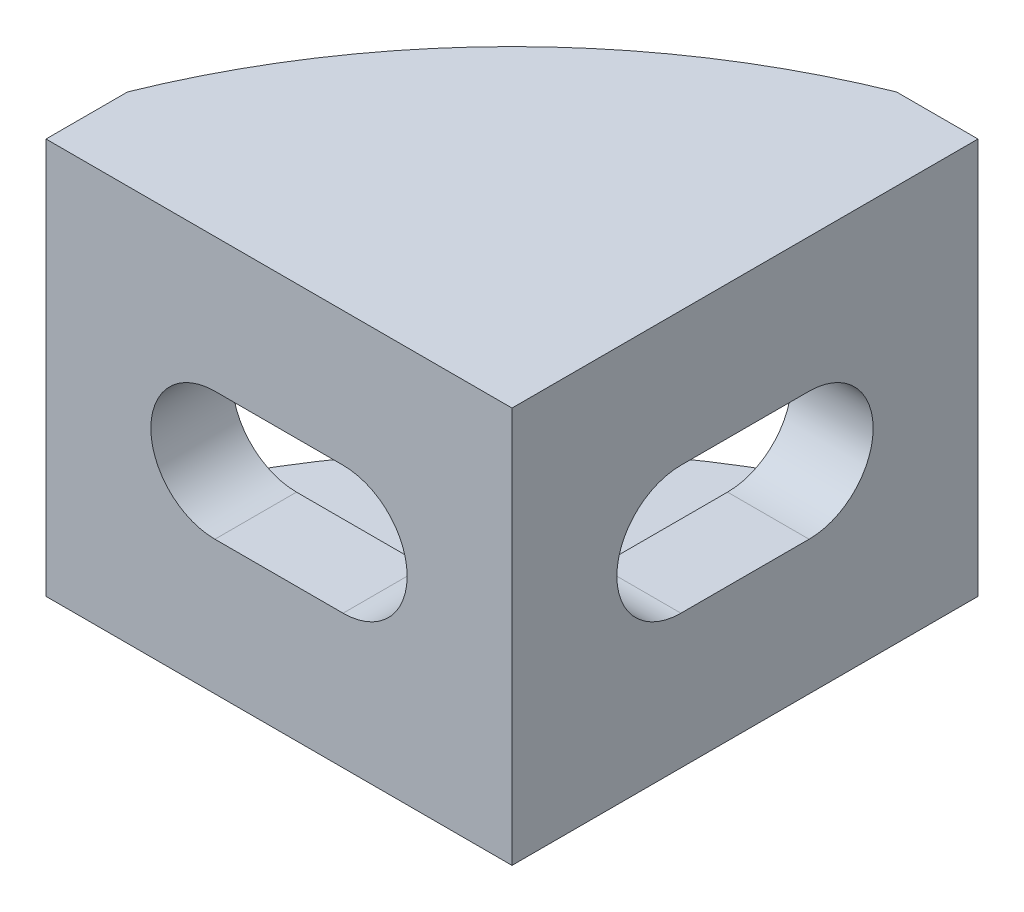
ISO-10303-21;
HEADER;
FILE_DESCRIPTION(('STEP AP214'),'2;1');
FILE_NAME('part.step','',(''),(''),'','','');
FILE_SCHEMA(('AUTOMOTIVE_DESIGN { 1 0 10303 214 1 1 1 1 }'));
ENDSEC;
DATA;
#1=APPLICATION_CONTEXT('core data for automotive mechanical design processes');
#2=APPLICATION_PROTOCOL_DEFINITION('international standard','automotive_design',2000,#1);
#3=PRODUCT_CONTEXT('',#1,'mechanical');
#4=PRODUCT('Part','Part','',(#3));
#5=PRODUCT_RELATED_PRODUCT_CATEGORY('part','',(#4));
#6=PRODUCT_DEFINITION_FORMATION('','',#4);
#7=PRODUCT_DEFINITION_CONTEXT('part definition',#1,'design');
#8=PRODUCT_DEFINITION('design','',#6,#7);
#9=PRODUCT_DEFINITION_SHAPE('','',#8);
#10=(LENGTH_UNIT() NAMED_UNIT(*) SI_UNIT(.MILLI.,.METRE.));
#11=(NAMED_UNIT(*) PLANE_ANGLE_UNIT() SI_UNIT($,.RADIAN.));
#12=(NAMED_UNIT(*) SI_UNIT($,.STERADIAN.) SOLID_ANGLE_UNIT());
#13=UNCERTAINTY_MEASURE_WITH_UNIT(LENGTH_MEASURE(1.E-05),#10,'distance_accuracy_value','');
#14=(GEOMETRIC_REPRESENTATION_CONTEXT(3) GLOBAL_UNCERTAINTY_ASSIGNED_CONTEXT((#13)) GLOBAL_UNIT_ASSIGNED_CONTEXT((#10,
#11,#12)) REPRESENTATION_CONTEXT('',''));
#15=CARTESIAN_POINT('',(0.,0.,0.));
#16=DIRECTION('',(0.,0.,1.));
#17=DIRECTION('',(1.,0.,0.));
#18=AXIS2_PLACEMENT_3D('',#15,#16,#17);
#19=CARTESIAN_POINT('',(7.60372741196111,8.5,7.60372741196111));
#20=DIRECTION('',(0.,-1.,0.));
#21=DIRECTION('',(0.,0.,-1.));
#22=AXIS2_PLACEMENT_3D('',#19,#20,#21);
#23=CYLINDRICAL_SURFACE('',#22,29.7532944305835);
#24=DIRECTION('',(0.,-1.,0.));
#25=VECTOR('',#24,1.);
#26=CARTESIAN_POINT('',(-20.,8.5,-3.5));
#27=LINE('',#26,#25);
#28=CARTESIAN_POINT('',(-20.,-6.5,-3.5));
#29=VERTEX_POINT('',#28);
#30=CARTESIAN_POINT('',(-20.,-8.5,-3.5));
#31=VERTEX_POINT('',#30);
#32=EDGE_CURVE('E262',#29,#31,#27,.T.);
#33=ORIENTED_EDGE('',*,*,#32,.F.);
#34=CARTESIAN_POINT('',(7.60372741196111,-6.5,7.60372741196111));
#35=DIRECTION('',(0.,-1.,0.));
#36=DIRECTION('',(0.,0.,-1.));
#37=AXIS2_PLACEMENT_3D('',#34,#35,#36);
#38=CIRCLE('',#37,29.7532944305835);
#39=CARTESIAN_POINT('',(-3.49999999999999,-6.5,-20.));
#40=VERTEX_POINT('',#39);
#41=EDGE_CURVE('E11',#29,#40,#38,.T.);
#42=ORIENTED_EDGE('',*,*,#41,.T.);
#43=DIRECTION('',(0.,-1.,0.));
#44=VECTOR('',#43,1.);
#45=CARTESIAN_POINT('',(-3.49999999999999,8.5,-20.));
#46=LINE('',#45,#44);
#47=CARTESIAN_POINT('',(-3.49999999999999,-8.5,-20.));
#48=VERTEX_POINT('',#47);
#49=EDGE_CURVE('E266',#40,#48,#46,.T.);
#50=ORIENTED_EDGE('',*,*,#49,.T.);
#51=CARTESIAN_POINT('',(7.60372741196111,-8.5,7.60372741196111));
#52=DIRECTION('',(0.,1.,0.));
#53=DIRECTION('',(0.,0.,1.));
#54=AXIS2_PLACEMENT_3D('',#51,#52,#53);
#55=CIRCLE('',#54,29.7532944305835);
#56=EDGE_CURVE('E246',#48,#31,#55,.T.);
#57=ORIENTED_EDGE('',*,*,#56,.T.);
#58=EDGE_LOOP('',(#33,#42,#50,#57));
#59=FACE_BOUND('',#58,.T.);
#60=ADVANCED_FACE('F33',(#59),#23,.T.);
#61=CARTESIAN_POINT('',(0.,8.5,-20.));
#62=DIRECTION('',(0.,0.,1.));
#63=DIRECTION('',(1.,0.,0.));
#64=AXIS2_PLACEMENT_3D('',#61,#62,#63);
#65=PLANE('',#64);
#66=DIRECTION('',(-1.,0.,0.));
#67=VECTOR('',#66,1.);
#68=CARTESIAN_POINT('',(0.,-8.5,-20.));
#69=LINE('',#68,#67);
#70=CARTESIAN_POINT('',(0.,-8.5,-20.));
#71=VERTEX_POINT('',#70);
#72=EDGE_CURVE('E229',#71,#48,#69,.T.);
#73=ORIENTED_EDGE('',*,*,#72,.T.);
#74=ORIENTED_EDGE('',*,*,#49,.F.);
#75=DIRECTION('',(0.,-1.,0.));
#76=VECTOR('',#75,1.);
#77=CARTESIAN_POINT('',(-3.49999999999999,-6.5,-20.));
#78=LINE('',#77,#76);
#79=CARTESIAN_POINT('',(-3.49999999999999,6.5,-20.));
#80=VERTEX_POINT('',#79);
#81=EDGE_CURVE('E219',#80,#40,#78,.T.);
#82=ORIENTED_EDGE('',*,*,#81,.F.);
#83=CARTESIAN_POINT('',(-3.49999999999999,8.5,-20.));
#84=VERTEX_POINT('',#83);
#85=EDGE_CURVE('E267',#84,#80,#46,.T.);
#86=ORIENTED_EDGE('',*,*,#85,.F.);
#87=DIRECTION('',(-1.,0.,0.));
#88=VECTOR('',#87,1.);
#89=CARTESIAN_POINT('',(0.,8.5,-20.));
#90=LINE('',#89,#88);
#91=CARTESIAN_POINT('',(0.,8.5,-20.));
#92=VERTEX_POINT('',#91);
#93=EDGE_CURVE('E231',#92,#84,#90,.T.);
#94=ORIENTED_EDGE('',*,*,#93,.F.);
#95=DIRECTION('',(0.,-1.,0.));
#96=VECTOR('',#95,1.);
#97=CARTESIAN_POINT('',(0.,8.5,-20.));
#98=LINE('',#97,#96);
#99=EDGE_CURVE('E243',#92,#71,#98,.T.);
#100=ORIENTED_EDGE('',*,*,#99,.T.);
#101=EDGE_LOOP('',(#73,#74,#82,#86,#94,#100));
#102=FACE_BOUND('',#101,.T.);
#103=ADVANCED_FACE('F35',(#102),#65,.F.);
#104=ORIENTED_EDGE('',*,*,#85,.T.);
#105=CARTESIAN_POINT('',(7.60372741196111,6.5,7.60372741196111));
#106=DIRECTION('',(0.,1.,0.));
#107=DIRECTION('',(0.,0.,1.));
#108=AXIS2_PLACEMENT_3D('',#105,#106,#107);
#109=CIRCLE('',#108,29.7532944305835);
#110=CARTESIAN_POINT('',(-20.,6.5,-3.5));
#111=VERTEX_POINT('',#110);
#112=EDGE_CURVE('E41',#80,#111,#109,.T.);
#113=ORIENTED_EDGE('',*,*,#112,.T.);
#114=CARTESIAN_POINT('',(-20.,8.5,-3.5));
#115=VERTEX_POINT('',#114);
#116=EDGE_CURVE('E263',#115,#111,#27,.T.);
#117=ORIENTED_EDGE('',*,*,#116,.F.);
#118=CARTESIAN_POINT('',(7.60372741196111,8.5,7.60372741196111));
#119=DIRECTION('',(0.,1.,0.));
#120=DIRECTION('',(0.,0.,1.));
#121=AXIS2_PLACEMENT_3D('',#118,#119,#120);
#122=CIRCLE('',#121,29.7532944305835);
#123=EDGE_CURVE('E234',#84,#115,#122,.T.);
#124=ORIENTED_EDGE('',*,*,#123,.F.);
#125=EDGE_LOOP('',(#104,#113,#117,#124));
#126=FACE_BOUND('',#125,.T.);
#127=ADVANCED_FACE('F272',(#126),#23,.T.);
#128=CARTESIAN_POINT('',(-20.,8.5,0.));
#129=DIRECTION('',(1.,0.,0.));
#130=DIRECTION('',(0.,0.,-1.));
#131=AXIS2_PLACEMENT_3D('',#128,#129,#130);
#132=PLANE('',#131);
#133=DIRECTION('',(0.,0.,1.));
#134=VECTOR('',#133,1.);
#135=CARTESIAN_POINT('',(-20.,-8.5,0.));
#136=LINE('',#135,#134);
#137=CARTESIAN_POINT('',(-20.,-8.5,0.));
#138=VERTEX_POINT('',#137);
#139=EDGE_CURVE('E249',#31,#138,#136,.T.);
#140=ORIENTED_EDGE('',*,*,#139,.T.);
#141=DIRECTION('',(0.,-1.,0.));
#142=VECTOR('',#141,1.);
#143=CARTESIAN_POINT('',(-20.,8.5,0.));
#144=LINE('',#143,#142);
#145=CARTESIAN_POINT('',(-20.,8.5,0.));
#146=VERTEX_POINT('',#145);
#147=EDGE_CURVE('E259',#146,#138,#144,.T.);
#148=ORIENTED_EDGE('',*,*,#147,.F.);
#149=DIRECTION('',(0.,0.,1.));
#150=VECTOR('',#149,1.);
#151=CARTESIAN_POINT('',(-20.,8.5,0.));
#152=LINE('',#151,#150);
#153=EDGE_CURVE('E237',#115,#146,#152,.T.);
#154=ORIENTED_EDGE('',*,*,#153,.F.);
#155=ORIENTED_EDGE('',*,*,#116,.T.);
#156=DIRECTION('',(0.,1.,0.));
#157=VECTOR('',#156,1.);
#158=CARTESIAN_POINT('',(-20.,-6.5,-3.5));
#159=LINE('',#158,#157);
#160=EDGE_CURVE('E212',#29,#111,#159,.T.);
#161=ORIENTED_EDGE('',*,*,#160,.F.);
#162=ORIENTED_EDGE('',*,*,#32,.T.);
#163=EDGE_LOOP('',(#140,#148,#154,#155,#161,#162));
#164=FACE_BOUND('',#163,.T.);
#165=ADVANCED_FACE('F279',(#164),#132,.F.);
#166=CARTESIAN_POINT('',(0.,8.5,0.));
#167=DIRECTION('',(0.,0.,-1.));
#168=DIRECTION('',(-1.,0.,0.));
#169=AXIS2_PLACEMENT_3D('',#166,#167,#168);
#170=PLANE('',#169);
#171=DIRECTION('',(-1.,0.,0.));
#172=VECTOR('',#171,1.);
#173=CARTESIAN_POINT('',(-7.25,2.75,0.));
#174=LINE('',#173,#172);
#175=CARTESIAN_POINT('',(-7.25,2.75,0.));
#176=VERTEX_POINT('',#175);
#177=CARTESIAN_POINT('',(-12.75,2.75,0.));
#178=VERTEX_POINT('',#177);
#179=EDGE_CURVE('E194',#176,#178,#174,.T.);
#180=ORIENTED_EDGE('',*,*,#179,.F.);
#181=CARTESIAN_POINT('',(-7.25,0.,0.));
#182=DIRECTION('',(0.,0.,1.));
#183=DIRECTION('',(1.,0.,0.));
#184=AXIS2_PLACEMENT_3D('',#181,#182,#183);
#185=CIRCLE('',#184,2.75);
#186=CARTESIAN_POINT('',(-7.25,-2.75,0.));
#187=VERTEX_POINT('',#186);
#188=EDGE_CURVE('E183',#187,#176,#185,.T.);
#189=ORIENTED_EDGE('',*,*,#188,.F.);
#190=DIRECTION('',(1.,0.,0.));
#191=VECTOR('',#190,1.);
#192=CARTESIAN_POINT('',(-12.75,-2.75,0.));
#193=LINE('',#192,#191);
#194=CARTESIAN_POINT('',(-12.75,-2.75,0.));
#195=VERTEX_POINT('',#194);
#196=EDGE_CURVE('E200',#195,#187,#193,.T.);
#197=ORIENTED_EDGE('',*,*,#196,.F.);
#198=CARTESIAN_POINT('',(-12.75,0.,0.));
#199=DIRECTION('',(0.,0.,1.));
#200=DIRECTION('',(1.,0.,0.));
#201=AXIS2_PLACEMENT_3D('',#198,#199,#200);
#202=CIRCLE('',#201,2.75);
#203=EDGE_CURVE('E197',#178,#195,#202,.T.);
#204=ORIENTED_EDGE('',*,*,#203,.F.);
#205=EDGE_LOOP('',(#180,#189,#197,#204));
#206=FACE_BOUND('',#205,.T.);
#207=DIRECTION('',(1.,0.,0.));
#208=VECTOR('',#207,1.);
#209=CARTESIAN_POINT('',(0.,-8.5,0.));
#210=LINE('',#209,#208);
#211=CARTESIAN_POINT('',(0.,-8.5,0.));
#212=VERTEX_POINT('',#211);
#213=EDGE_CURVE('E251',#138,#212,#210,.T.);
#214=ORIENTED_EDGE('',*,*,#213,.T.);
#215=DIRECTION('',(0.,-1.,0.));
#216=VECTOR('',#215,1.);
#217=CARTESIAN_POINT('',(0.,8.5,0.));
#218=LINE('',#217,#216);
#219=CARTESIAN_POINT('',(0.,8.5,0.));
#220=VERTEX_POINT('',#219);
#221=EDGE_CURVE('E256',#220,#212,#218,.T.);
#222=ORIENTED_EDGE('',*,*,#221,.F.);
#223=DIRECTION('',(1.,0.,0.));
#224=VECTOR('',#223,1.);
#225=CARTESIAN_POINT('',(0.,8.5,0.));
#226=LINE('',#225,#224);
#227=EDGE_CURVE('E239',#146,#220,#226,.T.);
#228=ORIENTED_EDGE('',*,*,#227,.F.);
#229=ORIENTED_EDGE('',*,*,#147,.T.);
#230=EDGE_LOOP('',(#214,#222,#228,#229));
#231=FACE_BOUND('',#230,.T.);
#232=ADVANCED_FACE('F303',(#206,#231),#170,.F.);
#233=CARTESIAN_POINT('',(0.,8.5,-20.));
#234=DIRECTION('',(-1.,0.,0.));
#235=DIRECTION('',(0.,0.,1.));
#236=AXIS2_PLACEMENT_3D('',#233,#234,#235);
#237=PLANE('',#236);
#238=CARTESIAN_POINT('',(0.,0.,-12.75));
#239=DIRECTION('',(1.,0.,0.));
#240=DIRECTION('',(0.,0.,1.));
#241=AXIS2_PLACEMENT_3D('',#238,#239,#240);
#242=CIRCLE('',#241,2.75);
#243=CARTESIAN_POINT('',(0.,-2.75,-12.75));
#244=VERTEX_POINT('',#243);
#245=CARTESIAN_POINT('',(0.,2.75,-12.75));
#246=VERTEX_POINT('',#245);
#247=EDGE_CURVE('E170',#244,#246,#242,.T.);
#248=ORIENTED_EDGE('',*,*,#247,.F.);
#249=DIRECTION('',(0.,0.,-1.));
#250=VECTOR('',#249,1.);
#251=CARTESIAN_POINT('',(0.,-2.75,-12.75));
#252=LINE('',#251,#250);
#253=CARTESIAN_POINT('',(0.,-2.75,-7.25));
#254=VERTEX_POINT('',#253);
#255=EDGE_CURVE('E163',#254,#244,#252,.T.);
#256=ORIENTED_EDGE('',*,*,#255,.F.);
#257=CARTESIAN_POINT('',(0.,0.,-7.25));
#258=DIRECTION('',(1.,0.,0.));
#259=DIRECTION('',(0.,0.,1.));
#260=AXIS2_PLACEMENT_3D('',#257,#258,#259);
#261=CIRCLE('',#260,2.75);
#262=CARTESIAN_POINT('',(0.,2.75,-7.25));
#263=VERTEX_POINT('',#262);
#264=EDGE_CURVE('E174',#263,#254,#261,.T.);
#265=ORIENTED_EDGE('',*,*,#264,.F.);
#266=DIRECTION('',(0.,0.,1.));
#267=VECTOR('',#266,1.);
#268=CARTESIAN_POINT('',(0.,2.75,-7.25));
#269=LINE('',#268,#267);
#270=EDGE_CURVE('E48',#246,#263,#269,.T.);
#271=ORIENTED_EDGE('',*,*,#270,.F.);
#272=EDGE_LOOP('',(#248,#256,#265,#271));
#273=FACE_BOUND('',#272,.T.);
#274=DIRECTION('',(0.,0.,-1.));
#275=VECTOR('',#274,1.);
#276=CARTESIAN_POINT('',(0.,-8.5,-20.));
#277=LINE('',#276,#275);
#278=EDGE_CURVE('E235',#212,#71,#277,.T.);
#279=ORIENTED_EDGE('',*,*,#278,.T.);
#280=ORIENTED_EDGE('',*,*,#99,.F.);
#281=DIRECTION('',(0.,0.,-1.));
#282=VECTOR('',#281,1.);
#283=CARTESIAN_POINT('',(0.,8.5,-20.));
#284=LINE('',#283,#282);
#285=EDGE_CURVE('E241',#220,#92,#284,.T.);
#286=ORIENTED_EDGE('',*,*,#285,.F.);
#287=ORIENTED_EDGE('',*,*,#221,.T.);
#288=EDGE_LOOP('',(#279,#280,#286,#287));
#289=FACE_BOUND('',#288,.T.);
#290=ADVANCED_FACE('F308',(#273,#289),#237,.F.);
#291=CARTESIAN_POINT('',(7.60372741196111,8.5,7.60372741196111));
#292=DIRECTION('',(0.,1.,0.));
#293=DIRECTION('',(0.,0.,1.));
#294=AXIS2_PLACEMENT_3D('',#291,#292,#293);
#295=PLANE('',#294);
#296=ORIENTED_EDGE('',*,*,#93,.T.);
#297=ORIENTED_EDGE('',*,*,#123,.T.);
#298=ORIENTED_EDGE('',*,*,#153,.T.);
#299=ORIENTED_EDGE('',*,*,#227,.T.);
#300=ORIENTED_EDGE('',*,*,#285,.T.);
#301=EDGE_LOOP('',(#296,#297,#298,#299,#300));
#302=FACE_BOUND('',#301,.T.);
#303=ADVANCED_FACE('F283',(#302),#295,.T.);
#304=CARTESIAN_POINT('',(7.60372741196111,-8.5,7.60372741196111));
#305=DIRECTION('',(0.,1.,0.));
#306=DIRECTION('',(0.,0.,1.));
#307=AXIS2_PLACEMENT_3D('',#304,#305,#306);
#308=PLANE('',#307);
#309=ORIENTED_EDGE('',*,*,#72,.F.);
#310=ORIENTED_EDGE('',*,*,#278,.F.);
#311=ORIENTED_EDGE('',*,*,#213,.F.);
#312=ORIENTED_EDGE('',*,*,#139,.F.);
#313=ORIENTED_EDGE('',*,*,#56,.F.);
#314=EDGE_LOOP('',(#309,#310,#311,#312,#313));
#315=FACE_BOUND('',#314,.T.);
#316=ADVANCED_FACE('F306',(#315),#308,.F.);
#317=CARTESIAN_POINT('',(-3.49999999999999,-6.5,-3.5));
#318=DIRECTION('',(0.,-1.,0.));
#319=DIRECTION('',(0.,0.,-1.));
#320=AXIS2_PLACEMENT_3D('',#317,#318,#319);
#321=PLANE('',#320);
#322=DIRECTION('',(-1.,0.,0.));
#323=VECTOR('',#322,1.);
#324=CARTESIAN_POINT('',(-3.49999999999999,-6.5,-3.5));
#325=LINE('',#324,#323);
#326=CARTESIAN_POINT('',(-3.49999999999999,-6.5,-3.5));
#327=VERTEX_POINT('',#326);
#328=EDGE_CURVE('E227',#327,#29,#325,.T.);
#329=ORIENTED_EDGE('',*,*,#328,.F.);
#330=DIRECTION('',(0.,0.,1.));
#331=VECTOR('',#330,1.);
#332=CARTESIAN_POINT('',(-3.49999999999999,-6.5,-3.5));
#333=LINE('',#332,#331);
#334=EDGE_CURVE('E221',#40,#327,#333,.T.);
#335=ORIENTED_EDGE('',*,*,#334,.F.);
#336=ORIENTED_EDGE('',*,*,#41,.F.);
#337=EDGE_LOOP('',(#329,#335,#336));
#338=FACE_BOUND('',#337,.T.);
#339=ADVANCED_FACE('F294',(#338),#321,.F.);
#340=CARTESIAN_POINT('',(-3.49999999999999,6.5,-3.5));
#341=DIRECTION('',(0.,1.,0.));
#342=DIRECTION('',(0.,0.,1.));
#343=AXIS2_PLACEMENT_3D('',#340,#341,#342);
#344=PLANE('',#343);
#345=DIRECTION('',(0.,0.,-1.));
#346=VECTOR('',#345,1.);
#347=CARTESIAN_POINT('',(-3.49999999999999,6.5,-3.5));
#348=LINE('',#347,#346);
#349=CARTESIAN_POINT('',(-3.49999999999999,6.5,-3.5));
#350=VERTEX_POINT('',#349);
#351=EDGE_CURVE('E216',#350,#80,#348,.T.);
#352=ORIENTED_EDGE('',*,*,#351,.F.);
#353=DIRECTION('',(-1.,0.,0.));
#354=VECTOR('',#353,1.);
#355=CARTESIAN_POINT('',(-3.49999999999999,6.5,-3.5));
#356=LINE('',#355,#354);
#357=EDGE_CURVE('E224',#350,#111,#356,.T.);
#358=ORIENTED_EDGE('',*,*,#357,.T.);
#359=ORIENTED_EDGE('',*,*,#112,.F.);
#360=EDGE_LOOP('',(#352,#358,#359));
#361=FACE_BOUND('',#360,.T.);
#362=ADVANCED_FACE('F343',(#361),#344,.F.);
#363=CARTESIAN_POINT('',(-3.49999999999999,-6.5,-3.5));
#364=DIRECTION('',(0.,0.,1.));
#365=DIRECTION('',(1.,0.,0.));
#366=AXIS2_PLACEMENT_3D('',#363,#364,#365);
#367=PLANE('',#366);
#368=DIRECTION('',(-1.,0.,0.));
#369=VECTOR('',#368,1.);
#370=CARTESIAN_POINT('',(-12.75,-2.75,-3.5));
#371=LINE('',#370,#369);
#372=CARTESIAN_POINT('',(-7.25,-2.75,-3.5));
#373=VERTEX_POINT('',#372);
#374=CARTESIAN_POINT('',(-12.75,-2.75,-3.5));
#375=VERTEX_POINT('',#374);
#376=EDGE_CURVE('E187',#373,#375,#371,.T.);
#377=ORIENTED_EDGE('',*,*,#376,.F.);
#378=CARTESIAN_POINT('',(-7.25,0.,-3.5));
#379=DIRECTION('',(0.,0.,1.));
#380=DIRECTION('',(1.,0.,0.));
#381=AXIS2_PLACEMENT_3D('',#378,#379,#380);
#382=CIRCLE('',#381,2.75);
#383=CARTESIAN_POINT('',(-7.25,2.75,-3.5));
#384=VERTEX_POINT('',#383);
#385=EDGE_CURVE('E190',#384,#373,#382,.F.);
#386=ORIENTED_EDGE('',*,*,#385,.F.);
#387=DIRECTION('',(1.,0.,0.));
#388=VECTOR('',#387,1.);
#389=CARTESIAN_POINT('',(-7.25,2.75,-3.5));
#390=LINE('',#389,#388);
#391=CARTESIAN_POINT('',(-12.75,2.75,-3.5));
#392=VERTEX_POINT('',#391);
#393=EDGE_CURVE('E192',#392,#384,#390,.T.);
#394=ORIENTED_EDGE('',*,*,#393,.F.);
#395=CARTESIAN_POINT('',(-12.75,0.,-3.5));
#396=DIRECTION('',(0.,0.,1.));
#397=DIRECTION('',(1.,0.,0.));
#398=AXIS2_PLACEMENT_3D('',#395,#396,#397);
#399=CIRCLE('',#398,2.75);
#400=EDGE_CURVE('E184',#375,#392,#399,.F.);
#401=ORIENTED_EDGE('',*,*,#400,.F.);
#402=EDGE_LOOP('',(#377,#386,#394,#401));
#403=FACE_BOUND('',#402,.T.);
#404=ORIENTED_EDGE('',*,*,#160,.T.);
#405=ORIENTED_EDGE('',*,*,#357,.F.);
#406=DIRECTION('',(0.,1.,0.));
#407=VECTOR('',#406,1.);
#408=CARTESIAN_POINT('',(-3.49999999999999,-6.5,-3.5));
#409=LINE('',#408,#407);
#410=EDGE_CURVE('E213',#327,#350,#409,.T.);
#411=ORIENTED_EDGE('',*,*,#410,.F.);
#412=ORIENTED_EDGE('',*,*,#328,.T.);
#413=EDGE_LOOP('',(#404,#405,#411,#412));
#414=FACE_BOUND('',#413,.T.);
#415=ADVANCED_FACE('F347',(#403,#414),#367,.F.);
#416=CARTESIAN_POINT('',(-3.49999999999999,0.,0.));
#417=DIRECTION('',(-1.,0.,0.));
#418=DIRECTION('',(0.,0.,1.));
#419=AXIS2_PLACEMENT_3D('',#416,#417,#418);
#420=PLANE('',#419);
#421=DIRECTION('',(0.,0.,-1.));
#422=VECTOR('',#421,1.);
#423=CARTESIAN_POINT('',(-3.49999999999999,-2.75,-12.75));
#424=LINE('',#423,#422);
#425=CARTESIAN_POINT('',(-3.49999999999999,-2.75,-7.25));
#426=VERTEX_POINT('',#425);
#427=CARTESIAN_POINT('',(-3.49999999999999,-2.75,-12.75));
#428=VERTEX_POINT('',#427);
#429=EDGE_CURVE('E160',#426,#428,#424,.T.);
#430=ORIENTED_EDGE('',*,*,#429,.T.);
#431=CARTESIAN_POINT('',(-3.49999999999999,0.,-12.75));
#432=DIRECTION('',(-1.,0.,0.));
#433=DIRECTION('',(0.,0.,1.));
#434=AXIS2_PLACEMENT_3D('',#431,#432,#433);
#435=CIRCLE('',#434,2.75);
#436=CARTESIAN_POINT('',(-3.49999999999999,2.75,-12.75));
#437=VERTEX_POINT('',#436);
#438=EDGE_CURVE('E147',#428,#437,#435,.F.);
#439=ORIENTED_EDGE('',*,*,#438,.T.);
#440=DIRECTION('',(0.,0.,1.));
#441=VECTOR('',#440,1.);
#442=CARTESIAN_POINT('',(-3.49999999999999,2.75,-7.25));
#443=LINE('',#442,#441);
#444=CARTESIAN_POINT('',(-3.49999999999999,2.75,-7.25));
#445=VERTEX_POINT('',#444);
#446=EDGE_CURVE('E178',#437,#445,#443,.T.);
#447=ORIENTED_EDGE('',*,*,#446,.T.);
#448=CARTESIAN_POINT('',(-3.49999999999999,0.,-7.25));
#449=DIRECTION('',(-1.,0.,0.));
#450=DIRECTION('',(0.,0.,1.));
#451=AXIS2_PLACEMENT_3D('',#448,#449,#450);
#452=CIRCLE('',#451,2.75);
#453=EDGE_CURVE('E168',#445,#426,#452,.F.);
#454=ORIENTED_EDGE('',*,*,#453,.T.);
#455=EDGE_LOOP('',(#430,#439,#447,#454));
#456=FACE_BOUND('',#455,.T.);
#457=ORIENTED_EDGE('',*,*,#410,.T.);
#458=ORIENTED_EDGE('',*,*,#351,.T.);
#459=ORIENTED_EDGE('',*,*,#81,.T.);
#460=ORIENTED_EDGE('',*,*,#334,.T.);
#461=EDGE_LOOP('',(#457,#458,#459,#460));
#462=FACE_BOUND('',#461,.T.);
#463=ADVANCED_FACE('F166',(#456,#462),#420,.T.);
#464=CARTESIAN_POINT('',(-7.25,0.,-15.7983738762488));
#465=DIRECTION('',(0.,0.,1.));
#466=DIRECTION('',(1.,0.,0.));
#467=AXIS2_PLACEMENT_3D('',#464,#465,#466);
#468=CYLINDRICAL_SURFACE('',#467,2.75);
#469=ORIENTED_EDGE('',*,*,#385,.T.);
#470=DIRECTION('',(0.,0.,1.));
#471=VECTOR('',#470,1.);
#472=CARTESIAN_POINT('',(-7.25,-2.75,-15.7983738762488));
#473=LINE('',#472,#471);
#474=EDGE_CURVE('E188',#373,#187,#473,.T.);
#475=ORIENTED_EDGE('',*,*,#474,.T.);
#476=ORIENTED_EDGE('',*,*,#188,.T.);
#477=DIRECTION('',(0.,0.,1.));
#478=VECTOR('',#477,1.);
#479=CARTESIAN_POINT('',(-7.25,2.75,-15.7983738762488));
#480=LINE('',#479,#478);
#481=EDGE_CURVE('E203',#384,#176,#480,.T.);
#482=ORIENTED_EDGE('',*,*,#481,.F.);
#483=EDGE_LOOP('',(#469,#475,#476,#482));
#484=FACE_BOUND('',#483,.T.);
#485=ADVANCED_FACE('F359',(#484),#468,.F.);
#486=CARTESIAN_POINT('',(-12.75,-2.75,-15.7983738762488));
#487=DIRECTION('',(0.,-1.,0.));
#488=DIRECTION('',(1.,0.,0.));
#489=AXIS2_PLACEMENT_3D('',#486,#487,#488);
#490=PLANE('',#489);
#491=ORIENTED_EDGE('',*,*,#376,.T.);
#492=DIRECTION('',(0.,0.,1.));
#493=VECTOR('',#492,1.);
#494=CARTESIAN_POINT('',(-12.75,-2.75,-15.7983738762488));
#495=LINE('',#494,#493);
#496=EDGE_CURVE('E205',#375,#195,#495,.T.);
#497=ORIENTED_EDGE('',*,*,#496,.T.);
#498=ORIENTED_EDGE('',*,*,#196,.T.);
#499=ORIENTED_EDGE('',*,*,#474,.F.);
#500=EDGE_LOOP('',(#491,#497,#498,#499));
#501=FACE_BOUND('',#500,.T.);
#502=ADVANCED_FACE('F364',(#501),#490,.F.);
#503=CARTESIAN_POINT('',(-12.75,0.,-15.7983738762488));
#504=DIRECTION('',(0.,0.,1.));
#505=DIRECTION('',(1.,0.,0.));
#506=AXIS2_PLACEMENT_3D('',#503,#504,#505);
#507=CYLINDRICAL_SURFACE('',#506,2.75);
#508=ORIENTED_EDGE('',*,*,#400,.T.);
#509=DIRECTION('',(0.,0.,1.));
#510=VECTOR('',#509,1.);
#511=CARTESIAN_POINT('',(-12.75,2.75,-15.7983738762488));
#512=LINE('',#511,#510);
#513=EDGE_CURVE('E207',#392,#178,#512,.T.);
#514=ORIENTED_EDGE('',*,*,#513,.T.);
#515=ORIENTED_EDGE('',*,*,#203,.T.);
#516=ORIENTED_EDGE('',*,*,#496,.F.);
#517=EDGE_LOOP('',(#508,#514,#515,#516));
#518=FACE_BOUND('',#517,.T.);
#519=ADVANCED_FACE('F374',(#518),#507,.F.);
#520=CARTESIAN_POINT('',(-7.25,2.75,-15.7983738762488));
#521=DIRECTION('',(0.,1.,0.));
#522=DIRECTION('',(0.,0.,1.));
#523=AXIS2_PLACEMENT_3D('',#520,#521,#522);
#524=PLANE('',#523);
#525=ORIENTED_EDGE('',*,*,#393,.T.);
#526=ORIENTED_EDGE('',*,*,#481,.T.);
#527=ORIENTED_EDGE('',*,*,#179,.T.);
#528=ORIENTED_EDGE('',*,*,#513,.F.);
#529=EDGE_LOOP('',(#525,#526,#527,#528));
#530=FACE_BOUND('',#529,.T.);
#531=ADVANCED_FACE('F384',(#530),#524,.F.);
#532=CARTESIAN_POINT('',(-15.7983738762488,-2.75,-12.75));
#533=DIRECTION('',(0.,-1.,0.));
#534=DIRECTION('',(0.,0.,-1.));
#535=AXIS2_PLACEMENT_3D('',#532,#533,#534);
#536=PLANE('',#535);
#537=DIRECTION('',(1.,0.,0.));
#538=VECTOR('',#537,1.);
#539=CARTESIAN_POINT('',(-15.7983738762488,-2.75,-7.25));
#540=LINE('',#539,#538);
#541=EDGE_CURVE('E56',#426,#254,#540,.T.);
#542=ORIENTED_EDGE('',*,*,#541,.T.);
#543=ORIENTED_EDGE('',*,*,#255,.T.);
#544=DIRECTION('',(1.,0.,0.));
#545=VECTOR('',#544,1.);
#546=CARTESIAN_POINT('',(-15.7983738762488,-2.75,-12.75));
#547=LINE('',#546,#545);
#548=EDGE_CURVE('E151',#428,#244,#547,.T.);
#549=ORIENTED_EDGE('',*,*,#548,.F.);
#550=ORIENTED_EDGE('',*,*,#429,.F.);
#551=EDGE_LOOP('',(#542,#543,#549,#550));
#552=FACE_BOUND('',#551,.T.);
#553=ADVANCED_FACE('F159',(#552),#536,.F.);
#554=CARTESIAN_POINT('',(-15.7983738762488,0.,-12.75));
#555=DIRECTION('',(1.,0.,0.));
#556=DIRECTION('',(0.,0.,-1.));
#557=AXIS2_PLACEMENT_3D('',#554,#555,#556);
#558=CYLINDRICAL_SURFACE('',#557,2.75);
#559=ORIENTED_EDGE('',*,*,#548,.T.);
#560=ORIENTED_EDGE('',*,*,#247,.T.);
#561=DIRECTION('',(1.,0.,0.));
#562=VECTOR('',#561,1.);
#563=CARTESIAN_POINT('',(-15.7983738762488,2.75,-12.75));
#564=LINE('',#563,#562);
#565=EDGE_CURVE('E153',#437,#246,#564,.T.);
#566=ORIENTED_EDGE('',*,*,#565,.F.);
#567=ORIENTED_EDGE('',*,*,#438,.F.);
#568=EDGE_LOOP('',(#559,#560,#566,#567));
#569=FACE_BOUND('',#568,.T.);
#570=ADVANCED_FACE('F149',(#569),#558,.F.);
#571=CARTESIAN_POINT('',(-15.7983738762488,2.75,-7.25));
#572=DIRECTION('',(0.,1.,0.));
#573=DIRECTION('',(0.,0.,1.));
#574=AXIS2_PLACEMENT_3D('',#571,#572,#573);
#575=PLANE('',#574);
#576=ORIENTED_EDGE('',*,*,#565,.T.);
#577=ORIENTED_EDGE('',*,*,#270,.T.);
#578=DIRECTION('',(1.,0.,0.));
#579=VECTOR('',#578,1.);
#580=CARTESIAN_POINT('',(-15.7983738762488,2.75,-7.25));
#581=LINE('',#580,#579);
#582=EDGE_CURVE('E177',#445,#263,#581,.T.);
#583=ORIENTED_EDGE('',*,*,#582,.F.);
#584=ORIENTED_EDGE('',*,*,#446,.F.);
#585=EDGE_LOOP('',(#576,#577,#583,#584));
#586=FACE_BOUND('',#585,.T.);
#587=ADVANCED_FACE('F421',(#586),#575,.F.);
#588=CARTESIAN_POINT('',(-15.7983738762488,0.,-7.25));
#589=DIRECTION('',(1.,0.,0.));
#590=DIRECTION('',(0.,0.,-1.));
#591=AXIS2_PLACEMENT_3D('',#588,#589,#590);
#592=CYLINDRICAL_SURFACE('',#591,2.75);
#593=ORIENTED_EDGE('',*,*,#582,.T.);
#594=ORIENTED_EDGE('',*,*,#264,.T.);
#595=ORIENTED_EDGE('',*,*,#541,.F.);
#596=ORIENTED_EDGE('',*,*,#453,.F.);
#597=EDGE_LOOP('',(#593,#594,#595,#596));
#598=FACE_BOUND('',#597,.T.);
#599=ADVANCED_FACE('F430',(#598),#592,.F.);
#600=CLOSED_SHELL('',(#60,#103,#127,#165,#232,#290,#303,#316,#339,#362,#415,#463,#485,#502,#519,
#531,#553,#570,#587,#599));
#601=MANIFOLD_SOLID_BREP('B2',#600);
#602=ADVANCED_BREP_SHAPE_REPRESENTATION('',(#18,#601),#14);
#603=SHAPE_DEFINITION_REPRESENTATION(#9,#602);
ENDSEC;
END-ISO-10303-21;
